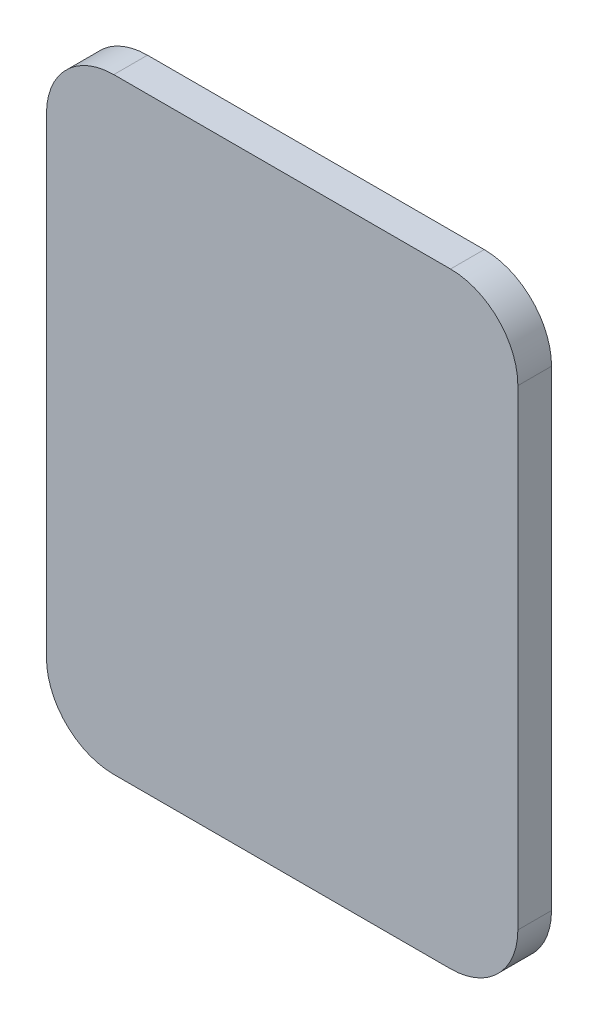
ISO-10303-21;
HEADER;
FILE_DESCRIPTION(('STEP AP214'),'2;1');
FILE_NAME('part.step','',(''),(''),'','','');
FILE_SCHEMA(('AUTOMOTIVE_DESIGN { 1 0 10303 214 1 1 1 1 }'));
ENDSEC;
DATA;
#1=APPLICATION_CONTEXT('core data for automotive mechanical design processes');
#2=APPLICATION_PROTOCOL_DEFINITION('international standard','automotive_design',2000,#1);
#3=PRODUCT_CONTEXT('',#1,'mechanical');
#4=PRODUCT('Part','Part','',(#3));
#5=PRODUCT_RELATED_PRODUCT_CATEGORY('part','',(#4));
#6=PRODUCT_DEFINITION_FORMATION('','',#4);
#7=PRODUCT_DEFINITION_CONTEXT('part definition',#1,'design');
#8=PRODUCT_DEFINITION('design','',#6,#7);
#9=PRODUCT_DEFINITION_SHAPE('','',#8);
#10=(LENGTH_UNIT() NAMED_UNIT(*) SI_UNIT(.MILLI.,.METRE.));
#11=(NAMED_UNIT(*) PLANE_ANGLE_UNIT() SI_UNIT($,.RADIAN.));
#12=(NAMED_UNIT(*) SI_UNIT($,.STERADIAN.) SOLID_ANGLE_UNIT());
#13=UNCERTAINTY_MEASURE_WITH_UNIT(LENGTH_MEASURE(1.E-05),#10,'distance_accuracy_value','');
#14=(GEOMETRIC_REPRESENTATION_CONTEXT(3) GLOBAL_UNCERTAINTY_ASSIGNED_CONTEXT((#13)) GLOBAL_UNIT_ASSIGNED_CONTEXT((#10,
#11,#12)) REPRESENTATION_CONTEXT('',''));
#15=CARTESIAN_POINT('',(0.,0.,0.));
#16=DIRECTION('',(0.,0.,1.));
#17=DIRECTION('',(1.,0.,0.));
#18=AXIS2_PLACEMENT_3D('',#15,#16,#17);
#19=CARTESIAN_POINT('',(0.,0.,0.));
#20=DIRECTION('',(0.,0.,1.));
#21=DIRECTION('',(1.,0.,0.));
#22=AXIS2_PLACEMENT_3D('',#19,#20,#21);
#23=PLANE('',#22);
#24=DIRECTION('',(1.,0.,0.));
#25=VECTOR('',#24,1.);
#26=CARTESIAN_POINT('',(7.50000000000001,28.,0.));
#27=LINE('',#26,#25);
#28=CARTESIAN_POINT('',(15.5,28.,0.));
#29=VERTEX_POINT('',#28);
#30=CARTESIAN_POINT('',(7.50000000000001,28.,0.));
#31=VERTEX_POINT('',#30);
#32=EDGE_CURVE('E234',#29,#31,#27,.F.);
#33=ORIENTED_EDGE('',*,*,#32,.T.);
#34=DIRECTION('',(0.,1.,0.));
#35=VECTOR('',#34,1.);
#36=CARTESIAN_POINT('',(7.50000000000001,25.,0.));
#37=LINE('',#36,#35);
#38=CARTESIAN_POINT('',(7.5,-28.,0.));
#39=VERTEX_POINT('',#38);
#40=EDGE_CURVE('E411',#39,#31,#37,.T.);
#41=ORIENTED_EDGE('',*,*,#40,.F.);
#42=DIRECTION('',(-1.,0.,0.));
#43=VECTOR('',#42,1.);
#44=CARTESIAN_POINT('',(12.5,-28.,0.));
#45=LINE('',#44,#43);
#46=CARTESIAN_POINT('',(15.5,-28.,0.));
#47=VERTEX_POINT('',#46);
#48=EDGE_CURVE('E245',#39,#47,#45,.F.);
#49=ORIENTED_EDGE('',*,*,#48,.T.);
#50=DIRECTION('',(0.,-1.,0.));
#51=VECTOR('',#50,1.);
#52=CARTESIAN_POINT('',(15.5,25.,0.));
#53=LINE('',#52,#51);
#54=EDGE_CURVE('E231',#47,#29,#53,.F.);
#55=ORIENTED_EDGE('',*,*,#54,.T.);
#56=EDGE_LOOP('',(#33,#41,#49,#55));
#57=FACE_BOUND('',#56,.T.);
#58=DIRECTION('',(1.,0.,0.));
#59=VECTOR('',#58,1.);
#60=CARTESIAN_POINT('',(-35.,-45.,0.));
#61=LINE('',#60,#59);
#62=CARTESIAN_POINT('',(-25.,-45.,0.));
#63=VERTEX_POINT('',#62);
#64=CARTESIAN_POINT('',(25.,-45.,0.));
#65=VERTEX_POINT('',#64);
#66=EDGE_CURVE('E377',#63,#65,#61,.T.);
#67=ORIENTED_EDGE('',*,*,#66,.F.);
#68=CARTESIAN_POINT('',(-25.,-35.,0.));
#69=DIRECTION('',(0.,0.,1.));
#70=DIRECTION('',(1.,0.,0.));
#71=AXIS2_PLACEMENT_3D('',#68,#69,#70);
#72=CIRCLE('',#71,10.);
#73=CARTESIAN_POINT('',(-35.,-35.,0.));
#74=VERTEX_POINT('',#73);
#75=EDGE_CURVE('E332',#63,#74,#72,.F.);
#76=ORIENTED_EDGE('',*,*,#75,.T.);
#77=DIRECTION('',(0.,-1.,0.));
#78=VECTOR('',#77,1.);
#79=CARTESIAN_POINT('',(-35.,45.,0.));
#80=LINE('',#79,#78);
#81=CARTESIAN_POINT('',(-35.,35.,0.));
#82=VERTEX_POINT('',#81);
#83=EDGE_CURVE('E369',#82,#74,#80,.T.);
#84=ORIENTED_EDGE('',*,*,#83,.F.);
#85=CARTESIAN_POINT('',(-25.,35.,0.));
#86=DIRECTION('',(0.,0.,1.));
#87=DIRECTION('',(1.,0.,0.));
#88=AXIS2_PLACEMENT_3D('',#85,#86,#87);
#89=CIRCLE('',#88,10.);
#90=CARTESIAN_POINT('',(-25.,45.,0.));
#91=VERTEX_POINT('',#90);
#92=EDGE_CURVE('E326',#82,#91,#89,.F.);
#93=ORIENTED_EDGE('',*,*,#92,.T.);
#94=DIRECTION('',(-1.,0.,0.));
#95=VECTOR('',#94,1.);
#96=CARTESIAN_POINT('',(-35.,45.,0.));
#97=LINE('',#96,#95);
#98=CARTESIAN_POINT('',(25.,45.,0.));
#99=VERTEX_POINT('',#98);
#100=EDGE_CURVE('E366',#99,#91,#97,.T.);
#101=ORIENTED_EDGE('',*,*,#100,.F.);
#102=CARTESIAN_POINT('',(25.,35.,0.));
#103=DIRECTION('',(0.,0.,1.));
#104=DIRECTION('',(1.,0.,0.));
#105=AXIS2_PLACEMENT_3D('',#102,#103,#104);
#106=CIRCLE('',#105,10.);
#107=CARTESIAN_POINT('',(35.,35.,0.));
#108=VERTEX_POINT('',#107);
#109=EDGE_CURVE('E328',#99,#108,#106,.F.);
#110=ORIENTED_EDGE('',*,*,#109,.T.);
#111=DIRECTION('',(0.,1.,0.));
#112=VECTOR('',#111,1.);
#113=CARTESIAN_POINT('',(35.,45.,0.));
#114=LINE('',#113,#112);
#115=CARTESIAN_POINT('',(35.,-35.,0.));
#116=VERTEX_POINT('',#115);
#117=EDGE_CURVE('E356',#116,#108,#114,.T.);
#118=ORIENTED_EDGE('',*,*,#117,.F.);
#119=CARTESIAN_POINT('',(25.,-35.,0.));
#120=DIRECTION('',(0.,0.,1.));
#121=DIRECTION('',(1.,0.,0.));
#122=AXIS2_PLACEMENT_3D('',#119,#120,#121);
#123=CIRCLE('',#122,10.);
#124=EDGE_CURVE('E330',#116,#65,#123,.F.);
#125=ORIENTED_EDGE('',*,*,#124,.T.);
#126=EDGE_LOOP('',(#67,#76,#84,#93,#101,#110,#118,#125));
#127=FACE_BOUND('',#126,.T.);
#128=DIRECTION('',(0.,-1.,0.));
#129=VECTOR('',#128,1.);
#130=CARTESIAN_POINT('',(-7.50000000000001,25.,0.));
#131=LINE('',#130,#129);
#132=CARTESIAN_POINT('',(-7.50000000000001,28.,0.));
#133=VERTEX_POINT('',#132);
#134=CARTESIAN_POINT('',(-7.50000000000001,-28.,0.));
#135=VERTEX_POINT('',#134);
#136=EDGE_CURVE('E399',#133,#135,#131,.T.);
#137=ORIENTED_EDGE('',*,*,#136,.F.);
#138=DIRECTION('',(1.,0.,0.));
#139=VECTOR('',#138,1.);
#140=CARTESIAN_POINT('',(-12.5,28.,0.));
#141=LINE('',#140,#139);
#142=CARTESIAN_POINT('',(-15.5,28.,0.));
#143=VERTEX_POINT('',#142);
#144=EDGE_CURVE('E224',#133,#143,#141,.F.);
#145=ORIENTED_EDGE('',*,*,#144,.T.);
#146=DIRECTION('',(0.,1.,0.));
#147=VECTOR('',#146,1.);
#148=CARTESIAN_POINT('',(-15.5,-25.,0.));
#149=LINE('',#148,#147);
#150=CARTESIAN_POINT('',(-15.5,-28.,0.));
#151=VERTEX_POINT('',#150);
#152=EDGE_CURVE('E250',#143,#151,#149,.F.);
#153=ORIENTED_EDGE('',*,*,#152,.T.);
#154=DIRECTION('',(-1.,0.,0.));
#155=VECTOR('',#154,1.);
#156=CARTESIAN_POINT('',(-7.50000000000001,-28.,0.));
#157=LINE('',#156,#155);
#158=EDGE_CURVE('E247',#151,#135,#157,.F.);
#159=ORIENTED_EDGE('',*,*,#158,.T.);
#160=EDGE_LOOP('',(#137,#145,#153,#159));
#161=FACE_BOUND('',#160,.T.);
#162=ADVANCED_FACE('F44',(#57,#127,#161),#23,.F.);
#163=CARTESIAN_POINT('',(35.,45.,5.));
#164=DIRECTION('',(-1.,0.,0.));
#165=DIRECTION('',(0.,-1.,0.));
#166=AXIS2_PLACEMENT_3D('',#163,#164,#165);
#167=PLANE('',#166);
#168=DIRECTION('',(0.,1.,0.));
#169=VECTOR('',#168,1.);
#170=CARTESIAN_POINT('',(35.,45.,5.));
#171=LINE('',#170,#169);
#172=CARTESIAN_POINT('',(35.,-35.,5.));
#173=VERTEX_POINT('',#172);
#174=CARTESIAN_POINT('',(35.,35.,5.));
#175=VERTEX_POINT('',#174);
#176=EDGE_CURVE('E358',#173,#175,#171,.T.);
#177=ORIENTED_EDGE('',*,*,#176,.F.);
#178=DIRECTION('',(0.,0.,-1.));
#179=VECTOR('',#178,1.);
#180=CARTESIAN_POINT('',(35.,-35.,5.));
#181=LINE('',#180,#179);
#182=EDGE_CURVE('E348',#173,#116,#181,.T.);
#183=ORIENTED_EDGE('',*,*,#182,.T.);
#184=ORIENTED_EDGE('',*,*,#117,.T.);
#185=DIRECTION('',(0.,0.,-1.));
#186=VECTOR('',#185,1.);
#187=CARTESIAN_POINT('',(35.,35.,5.));
#188=LINE('',#187,#186);
#189=EDGE_CURVE('E346',#108,#175,#188,.F.);
#190=ORIENTED_EDGE('',*,*,#189,.T.);
#191=EDGE_LOOP('',(#177,#183,#184,#190));
#192=FACE_BOUND('',#191,.T.);
#193=ADVANCED_FACE('F355',(#192),#167,.F.);
#194=CARTESIAN_POINT('',(-35.,45.,5.));
#195=DIRECTION('',(0.,-1.,0.));
#196=DIRECTION('',(0.,0.,-1.));
#197=AXIS2_PLACEMENT_3D('',#194,#195,#196);
#198=PLANE('',#197);
#199=DIRECTION('',(-1.,0.,0.));
#200=VECTOR('',#199,1.);
#201=CARTESIAN_POINT('',(-35.,45.,5.));
#202=LINE('',#201,#200);
#203=CARTESIAN_POINT('',(25.,45.,5.));
#204=VERTEX_POINT('',#203);
#205=CARTESIAN_POINT('',(-25.,45.,5.));
#206=VERTEX_POINT('',#205);
#207=EDGE_CURVE('E425',#204,#206,#202,.T.);
#208=ORIENTED_EDGE('',*,*,#207,.F.);
#209=DIRECTION('',(0.,0.,-1.));
#210=VECTOR('',#209,1.);
#211=CARTESIAN_POINT('',(25.,45.,5.));
#212=LINE('',#211,#210);
#213=EDGE_CURVE('E13',#204,#99,#212,.T.);
#214=ORIENTED_EDGE('',*,*,#213,.T.);
#215=ORIENTED_EDGE('',*,*,#100,.T.);
#216=DIRECTION('',(0.,0.,-1.));
#217=VECTOR('',#216,1.);
#218=CARTESIAN_POINT('',(-25.,45.,5.));
#219=LINE('',#218,#217);
#220=EDGE_CURVE('E52',#91,#206,#219,.F.);
#221=ORIENTED_EDGE('',*,*,#220,.T.);
#222=EDGE_LOOP('',(#208,#214,#215,#221));
#223=FACE_BOUND('',#222,.T.);
#224=ADVANCED_FACE('F444',(#223),#198,.F.);
#225=CARTESIAN_POINT('',(-35.,45.,5.));
#226=DIRECTION('',(1.,0.,0.));
#227=DIRECTION('',(0.,1.,0.));
#228=AXIS2_PLACEMENT_3D('',#225,#226,#227);
#229=PLANE('',#228);
#230=ORIENTED_EDGE('',*,*,#83,.T.);
#231=DIRECTION('',(0.,0.,-1.));
#232=VECTOR('',#231,1.);
#233=CARTESIAN_POINT('',(-35.,-35.,5.));
#234=LINE('',#233,#232);
#235=CARTESIAN_POINT('',(-35.,-35.,5.));
#236=VERTEX_POINT('',#235);
#237=EDGE_CURVE('E337',#74,#236,#234,.F.);
#238=ORIENTED_EDGE('',*,*,#237,.T.);
#239=DIRECTION('',(0.,-1.,0.));
#240=VECTOR('',#239,1.);
#241=CARTESIAN_POINT('',(-35.,45.,5.));
#242=LINE('',#241,#240);
#243=CARTESIAN_POINT('',(-35.,35.,5.));
#244=VERTEX_POINT('',#243);
#245=EDGE_CURVE('E237',#244,#236,#242,.T.);
#246=ORIENTED_EDGE('',*,*,#245,.F.);
#247=DIRECTION('',(0.,0.,-1.));
#248=VECTOR('',#247,1.);
#249=CARTESIAN_POINT('',(-35.,35.,5.));
#250=LINE('',#249,#248);
#251=EDGE_CURVE('E334',#244,#82,#250,.T.);
#252=ORIENTED_EDGE('',*,*,#251,.T.);
#253=EDGE_LOOP('',(#230,#238,#246,#252));
#254=FACE_BOUND('',#253,.T.);
#255=ADVANCED_FACE('F442',(#254),#229,.F.);
#256=CARTESIAN_POINT('',(-35.,-45.,5.));
#257=DIRECTION('',(0.,1.,0.));
#258=DIRECTION('',(0.,0.,1.));
#259=AXIS2_PLACEMENT_3D('',#256,#257,#258);
#260=PLANE('',#259);
#261=DIRECTION('',(1.,0.,0.));
#262=VECTOR('',#261,1.);
#263=CARTESIAN_POINT('',(-35.,-45.,5.));
#264=LINE('',#263,#262);
#265=CARTESIAN_POINT('',(-25.,-45.,5.));
#266=VERTEX_POINT('',#265);
#267=CARTESIAN_POINT('',(25.,-45.,5.));
#268=VERTEX_POINT('',#267);
#269=EDGE_CURVE('E232',#266,#268,#264,.T.);
#270=ORIENTED_EDGE('',*,*,#269,.F.);
#271=DIRECTION('',(0.,0.,-1.));
#272=VECTOR('',#271,1.);
#273=CARTESIAN_POINT('',(-25.,-45.,5.));
#274=LINE('',#273,#272);
#275=EDGE_CURVE('E323',#266,#63,#274,.T.);
#276=ORIENTED_EDGE('',*,*,#275,.T.);
#277=ORIENTED_EDGE('',*,*,#66,.T.);
#278=DIRECTION('',(0.,0.,-1.));
#279=VECTOR('',#278,1.);
#280=CARTESIAN_POINT('',(25.,-45.,5.));
#281=LINE('',#280,#279);
#282=EDGE_CURVE('E321',#65,#268,#281,.F.);
#283=ORIENTED_EDGE('',*,*,#282,.T.);
#284=EDGE_LOOP('',(#270,#276,#277,#283));
#285=FACE_BOUND('',#284,.T.);
#286=ADVANCED_FACE('F439',(#285),#260,.F.);
#287=CARTESIAN_POINT('',(0.,0.,5.));
#288=DIRECTION('',(0.,0.,1.));
#289=DIRECTION('',(1.,0.,0.));
#290=AXIS2_PLACEMENT_3D('',#287,#288,#289);
#291=PLANE('',#290);
#292=ORIENTED_EDGE('',*,*,#245,.T.);
#293=CARTESIAN_POINT('',(-25.,-35.,5.));
#294=DIRECTION('',(0.,0.,1.));
#295=DIRECTION('',(1.,0.,0.));
#296=AXIS2_PLACEMENT_3D('',#293,#294,#295);
#297=CIRCLE('',#296,10.);
#298=EDGE_CURVE('E344',#236,#266,#297,.T.);
#299=ORIENTED_EDGE('',*,*,#298,.T.);
#300=ORIENTED_EDGE('',*,*,#269,.T.);
#301=CARTESIAN_POINT('',(25.,-35.,5.));
#302=DIRECTION('',(0.,0.,1.));
#303=DIRECTION('',(1.,0.,0.));
#304=AXIS2_PLACEMENT_3D('',#301,#302,#303);
#305=CIRCLE('',#304,10.);
#306=EDGE_CURVE('E342',#268,#173,#305,.T.);
#307=ORIENTED_EDGE('',*,*,#306,.T.);
#308=ORIENTED_EDGE('',*,*,#176,.T.);
#309=CARTESIAN_POINT('',(25.,35.,5.));
#310=DIRECTION('',(0.,0.,1.));
#311=DIRECTION('',(1.,0.,0.));
#312=AXIS2_PLACEMENT_3D('',#309,#310,#311);
#313=CIRCLE('',#312,10.);
#314=EDGE_CURVE('E65',#175,#204,#313,.T.);
#315=ORIENTED_EDGE('',*,*,#314,.T.);
#316=ORIENTED_EDGE('',*,*,#207,.T.);
#317=CARTESIAN_POINT('',(-25.,35.,5.));
#318=DIRECTION('',(0.,0.,1.));
#319=DIRECTION('',(1.,0.,0.));
#320=AXIS2_PLACEMENT_3D('',#317,#318,#319);
#321=CIRCLE('',#320,10.);
#322=EDGE_CURVE('E339',#206,#244,#321,.T.);
#323=ORIENTED_EDGE('',*,*,#322,.T.);
#324=EDGE_LOOP('',(#292,#299,#300,#307,#308,#315,#316,#323));
#325=FACE_BOUND('',#324,.T.);
#326=ADVANCED_FACE('F429',(#325),#291,.T.);
#327=CARTESIAN_POINT('',(7.50000000000001,25.,-20.));
#328=DIRECTION('',(1.,0.,0.));
#329=DIRECTION('',(0.,1.,0.));
#330=AXIS2_PLACEMENT_3D('',#327,#328,#329);
#331=PLANE('',#330);
#332=CARTESIAN_POINT('',(7.5,-12.5,-10.));
#333=DIRECTION('',(1.,0.,0.));
#334=DIRECTION('',(0.,1.,0.));
#335=AXIS2_PLACEMENT_3D('',#332,#333,#334);
#336=CIRCLE('',#335,3.);
#337=CARTESIAN_POINT('',(7.5,-9.5,-10.));
#338=VERTEX_POINT('',#337);
#339=EDGE_CURVE('E388',#338,#338,#336,.T.);
#340=ORIENTED_EDGE('',*,*,#339,.T.);
#341=EDGE_LOOP('',(#340));
#342=FACE_BOUND('',#341,.T.);
#343=CARTESIAN_POINT('',(7.50000000000001,12.5,-10.));
#344=DIRECTION('',(1.,0.,0.));
#345=DIRECTION('',(0.,1.,0.));
#346=AXIS2_PLACEMENT_3D('',#343,#344,#345);
#347=CIRCLE('',#346,3.);
#348=CARTESIAN_POINT('',(7.50000000000001,15.5,-10.));
#349=VERTEX_POINT('',#348);
#350=EDGE_CURVE('E385',#349,#349,#347,.T.);
#351=ORIENTED_EDGE('',*,*,#350,.T.);
#352=EDGE_LOOP('',(#351));
#353=FACE_BOUND('',#352,.T.);
#354=DIRECTION('',(0.,1.,0.));
#355=VECTOR('',#354,1.);
#356=CARTESIAN_POINT('',(7.50000000000001,25.,-20.));
#357=LINE('',#356,#355);
#358=CARTESIAN_POINT('',(7.5,-15.,-20.));
#359=VERTEX_POINT('',#358);
#360=CARTESIAN_POINT('',(7.5,15.,-20.));
#361=VERTEX_POINT('',#360);
#362=EDGE_CURVE('E412',#359,#361,#357,.T.);
#363=ORIENTED_EDGE('',*,*,#362,.F.);
#364=CARTESIAN_POINT('',(7.5,-15.,-10.));
#365=DIRECTION('',(1.,0.,0.));
#366=DIRECTION('',(0.,1.,0.));
#367=AXIS2_PLACEMENT_3D('',#364,#365,#366);
#368=CIRCLE('',#367,10.);
#369=CARTESIAN_POINT('',(7.5,-25.,-10.));
#370=VERTEX_POINT('',#369);
#371=EDGE_CURVE('E311',#359,#370,#368,.F.);
#372=ORIENTED_EDGE('',*,*,#371,.T.);
#373=DIRECTION('',(0.,0.,1.));
#374=VECTOR('',#373,1.);
#375=CARTESIAN_POINT('',(7.5,-25.,-20.));
#376=LINE('',#375,#374);
#377=CARTESIAN_POINT('',(7.5,-25.,-3.));
#378=VERTEX_POINT('',#377);
#379=EDGE_CURVE('E418',#370,#378,#376,.T.);
#380=ORIENTED_EDGE('',*,*,#379,.T.);
#381=CARTESIAN_POINT('',(7.5,-28.,-3.));
#382=DIRECTION('',(1.,0.,0.));
#383=DIRECTION('',(0.,1.,0.));
#384=AXIS2_PLACEMENT_3D('',#381,#382,#383);
#385=CIRCLE('',#384,3.);
#386=EDGE_CURVE('E268',#378,#39,#385,.T.);
#387=ORIENTED_EDGE('',*,*,#386,.T.);
#388=ORIENTED_EDGE('',*,*,#40,.T.);
#389=CARTESIAN_POINT('',(7.50000000000001,28.,-3.));
#390=DIRECTION('',(1.,0.,0.));
#391=DIRECTION('',(0.,1.,0.));
#392=AXIS2_PLACEMENT_3D('',#389,#390,#391);
#393=CIRCLE('',#392,3.);
#394=CARTESIAN_POINT('',(7.50000000000001,25.,-3.));
#395=VERTEX_POINT('',#394);
#396=EDGE_CURVE('E271',#31,#395,#393,.T.);
#397=ORIENTED_EDGE('',*,*,#396,.T.);
#398=DIRECTION('',(0.,0.,1.));
#399=VECTOR('',#398,1.);
#400=CARTESIAN_POINT('',(7.50000000000001,25.,-20.));
#401=LINE('',#400,#399);
#402=CARTESIAN_POINT('',(7.50000000000001,25.,-10.));
#403=VERTEX_POINT('',#402);
#404=EDGE_CURVE('E367',#403,#395,#401,.T.);
#405=ORIENTED_EDGE('',*,*,#404,.F.);
#406=CARTESIAN_POINT('',(7.5,15.,-10.));
#407=DIRECTION('',(1.,0.,0.));
#408=DIRECTION('',(0.,1.,0.));
#409=AXIS2_PLACEMENT_3D('',#406,#407,#408);
#410=CIRCLE('',#409,10.);
#411=EDGE_CURVE('E309',#403,#361,#410,.F.);
#412=ORIENTED_EDGE('',*,*,#411,.T.);
#413=EDGE_LOOP('',(#363,#372,#380,#387,#388,#397,#405,#412));
#414=FACE_BOUND('',#413,.T.);
#415=ADVANCED_FACE('F518',(#342,#353,#414),#331,.F.);
#416=CARTESIAN_POINT('',(12.5,25.,-20.));
#417=DIRECTION('',(0.,-1.,0.));
#418=DIRECTION('',(0.,0.,-1.));
#419=AXIS2_PLACEMENT_3D('',#416,#417,#418);
#420=PLANE('',#419);
#421=DIRECTION('',(0.,0.,1.));
#422=VECTOR('',#421,1.);
#423=CARTESIAN_POINT('',(12.5,25.,-20.));
#424=LINE('',#423,#422);
#425=CARTESIAN_POINT('',(12.5,25.,-10.));
#426=VERTEX_POINT('',#425);
#427=CARTESIAN_POINT('',(12.5,25.,-3.));
#428=VERTEX_POINT('',#427);
#429=EDGE_CURVE('E371',#426,#428,#424,.T.);
#430=ORIENTED_EDGE('',*,*,#429,.F.);
#431=DIRECTION('',(1.,0.,0.));
#432=VECTOR('',#431,1.);
#433=CARTESIAN_POINT('',(7.50000000000001,25.,-10.));
#434=LINE('',#433,#432);
#435=EDGE_CURVE('E319',#426,#403,#434,.F.);
#436=ORIENTED_EDGE('',*,*,#435,.T.);
#437=ORIENTED_EDGE('',*,*,#404,.T.);
#438=DIRECTION('',(1.,0.,0.));
#439=VECTOR('',#438,1.);
#440=CARTESIAN_POINT('',(12.5,25.,-3.));
#441=LINE('',#440,#439);
#442=EDGE_CURVE('E261',#395,#428,#441,.T.);
#443=ORIENTED_EDGE('',*,*,#442,.T.);
#444=EDGE_LOOP('',(#430,#436,#437,#443));
#445=FACE_BOUND('',#444,.T.);
#446=ADVANCED_FACE('F541',(#445),#420,.F.);
#447=CARTESIAN_POINT('',(12.5,25.,-20.));
#448=DIRECTION('',(-1.,0.,0.));
#449=DIRECTION('',(0.,-1.,0.));
#450=AXIS2_PLACEMENT_3D('',#447,#448,#449);
#451=PLANE('',#450);
#452=CARTESIAN_POINT('',(12.5,-12.5,-10.));
#453=DIRECTION('',(1.,0.,0.));
#454=DIRECTION('',(0.,1.,0.));
#455=AXIS2_PLACEMENT_3D('',#452,#453,#454);
#456=CIRCLE('',#455,3.);
#457=CARTESIAN_POINT('',(12.5,-9.5,-10.));
#458=VERTEX_POINT('',#457);
#459=EDGE_CURVE('E281',#458,#458,#456,.T.);
#460=ORIENTED_EDGE('',*,*,#459,.F.);
#461=EDGE_LOOP('',(#460));
#462=FACE_BOUND('',#461,.T.);
#463=CARTESIAN_POINT('',(12.5,12.5,-10.));
#464=DIRECTION('',(1.,0.,0.));
#465=DIRECTION('',(0.,1.,0.));
#466=AXIS2_PLACEMENT_3D('',#463,#464,#465);
#467=CIRCLE('',#466,3.);
#468=CARTESIAN_POINT('',(12.5,15.5,-10.));
#469=VERTEX_POINT('',#468);
#470=EDGE_CURVE('E381',#469,#469,#467,.T.);
#471=ORIENTED_EDGE('',*,*,#470,.F.);
#472=EDGE_LOOP('',(#471));
#473=FACE_BOUND('',#472,.T.);
#474=DIRECTION('',(0.,0.,1.));
#475=VECTOR('',#474,1.);
#476=CARTESIAN_POINT('',(12.5,-25.,-20.));
#477=LINE('',#476,#475);
#478=CARTESIAN_POINT('',(12.5,-25.,-10.));
#479=VERTEX_POINT('',#478);
#480=CARTESIAN_POINT('',(12.5,-25.,-3.));
#481=VERTEX_POINT('',#480);
#482=EDGE_CURVE('E421',#479,#481,#477,.T.);
#483=ORIENTED_EDGE('',*,*,#482,.F.);
#484=CARTESIAN_POINT('',(12.5,-15.,-10.));
#485=DIRECTION('',(-1.,0.,0.));
#486=DIRECTION('',(0.,-1.,0.));
#487=AXIS2_PLACEMENT_3D('',#484,#485,#486);
#488=CIRCLE('',#487,10.);
#489=CARTESIAN_POINT('',(12.5,-15.,-20.));
#490=VERTEX_POINT('',#489);
#491=EDGE_CURVE('E317',#479,#490,#488,.F.);
#492=ORIENTED_EDGE('',*,*,#491,.T.);
#493=DIRECTION('',(0.,-1.,0.));
#494=VECTOR('',#493,1.);
#495=CARTESIAN_POINT('',(12.5,25.,-20.));
#496=LINE('',#495,#494);
#497=CARTESIAN_POINT('',(12.5,15.,-20.));
#498=VERTEX_POINT('',#497);
#499=EDGE_CURVE('E415',#498,#490,#496,.T.);
#500=ORIENTED_EDGE('',*,*,#499,.F.);
#501=CARTESIAN_POINT('',(12.5,15.,-10.));
#502=DIRECTION('',(-1.,0.,0.));
#503=DIRECTION('',(0.,-1.,0.));
#504=AXIS2_PLACEMENT_3D('',#501,#502,#503);
#505=CIRCLE('',#504,10.);
#506=EDGE_CURVE('E315',#498,#426,#505,.F.);
#507=ORIENTED_EDGE('',*,*,#506,.T.);
#508=ORIENTED_EDGE('',*,*,#429,.T.);
#509=DIRECTION('',(0.,-1.,0.));
#510=VECTOR('',#509,1.);
#511=CARTESIAN_POINT('',(12.5,-25.,-3.));
#512=LINE('',#511,#510);
#513=EDGE_CURVE('E226',#428,#481,#512,.T.);
#514=ORIENTED_EDGE('',*,*,#513,.T.);
#515=EDGE_LOOP('',(#483,#492,#500,#507,#508,#514));
#516=FACE_BOUND('',#515,.T.);
#517=ADVANCED_FACE('F543',(#462,#473,#516),#451,.F.);
#518=CARTESIAN_POINT('',(12.5,-25.,-20.));
#519=DIRECTION('',(0.,1.,0.));
#520=DIRECTION('',(0.,0.,1.));
#521=AXIS2_PLACEMENT_3D('',#518,#519,#520);
#522=PLANE('',#521);
#523=ORIENTED_EDGE('',*,*,#379,.F.);
#524=DIRECTION('',(-1.,0.,0.));
#525=VECTOR('',#524,1.);
#526=CARTESIAN_POINT('',(12.5,-25.,-10.));
#527=LINE('',#526,#525);
#528=EDGE_CURVE('E313',#370,#479,#527,.F.);
#529=ORIENTED_EDGE('',*,*,#528,.T.);
#530=ORIENTED_EDGE('',*,*,#482,.T.);
#531=DIRECTION('',(-1.,0.,0.));
#532=VECTOR('',#531,1.);
#533=CARTESIAN_POINT('',(7.5,-25.,-3.));
#534=LINE('',#533,#532);
#535=EDGE_CURVE('E258',#481,#378,#534,.T.);
#536=ORIENTED_EDGE('',*,*,#535,.T.);
#537=EDGE_LOOP('',(#523,#529,#530,#536));
#538=FACE_BOUND('',#537,.T.);
#539=ADVANCED_FACE('F528',(#538),#522,.F.);
#540=CARTESIAN_POINT('',(0.,0.,-20.));
#541=DIRECTION('',(0.,0.,-1.));
#542=DIRECTION('',(-1.,0.,0.));
#543=AXIS2_PLACEMENT_3D('',#540,#541,#542);
#544=PLANE('',#543);
#545=ORIENTED_EDGE('',*,*,#499,.T.);
#546=DIRECTION('',(-1.,0.,0.));
#547=VECTOR('',#546,1.);
#548=CARTESIAN_POINT('',(7.5,-15.,-20.));
#549=LINE('',#548,#547);
#550=EDGE_CURVE('E306',#490,#359,#549,.T.);
#551=ORIENTED_EDGE('',*,*,#550,.T.);
#552=ORIENTED_EDGE('',*,*,#362,.T.);
#553=DIRECTION('',(1.,0.,0.));
#554=VECTOR('',#553,1.);
#555=CARTESIAN_POINT('',(12.5,15.,-20.));
#556=LINE('',#555,#554);
#557=EDGE_CURVE('E303',#361,#498,#556,.T.);
#558=ORIENTED_EDGE('',*,*,#557,.T.);
#559=EDGE_LOOP('',(#545,#551,#552,#558));
#560=FACE_BOUND('',#559,.T.);
#561=ADVANCED_FACE('F520',(#560),#544,.T.);
#562=CARTESIAN_POINT('',(-12.5,25.,-20.));
#563=DIRECTION('',(1.,0.,0.));
#564=DIRECTION('',(0.,1.,0.));
#565=AXIS2_PLACEMENT_3D('',#562,#563,#564);
#566=PLANE('',#565);
#567=CARTESIAN_POINT('',(-12.5,-12.5,-10.));
#568=DIRECTION('',(1.,0.,0.));
#569=DIRECTION('',(0.,1.,0.));
#570=AXIS2_PLACEMENT_3D('',#567,#568,#569);
#571=CIRCLE('',#570,3.);
#572=CARTESIAN_POINT('',(-12.5,-9.5,-10.));
#573=VERTEX_POINT('',#572);
#574=EDGE_CURVE('E393',#573,#573,#571,.T.);
#575=ORIENTED_EDGE('',*,*,#574,.T.);
#576=EDGE_LOOP('',(#575));
#577=FACE_BOUND('',#576,.T.);
#578=CARTESIAN_POINT('',(-12.5,12.5,-10.));
#579=DIRECTION('',(1.,0.,0.));
#580=DIRECTION('',(0.,1.,0.));
#581=AXIS2_PLACEMENT_3D('',#578,#579,#580);
#582=CIRCLE('',#581,3.);
#583=CARTESIAN_POINT('',(-12.5,15.5,-10.));
#584=VERTEX_POINT('',#583);
#585=EDGE_CURVE('E380',#584,#584,#582,.T.);
#586=ORIENTED_EDGE('',*,*,#585,.T.);
#587=EDGE_LOOP('',(#586));
#588=FACE_BOUND('',#587,.T.);
#589=DIRECTION('',(0.,0.,1.));
#590=VECTOR('',#589,1.);
#591=CARTESIAN_POINT('',(-12.5,25.,-20.));
#592=LINE('',#591,#590);
#593=CARTESIAN_POINT('',(-12.5,25.,-10.));
#594=VERTEX_POINT('',#593);
#595=CARTESIAN_POINT('',(-12.5,25.,-3.));
#596=VERTEX_POINT('',#595);
#597=EDGE_CURVE('E216',#594,#596,#592,.T.);
#598=ORIENTED_EDGE('',*,*,#597,.F.);
#599=CARTESIAN_POINT('',(-12.5,15.,-10.));
#600=DIRECTION('',(1.,0.,0.));
#601=DIRECTION('',(0.,1.,0.));
#602=AXIS2_PLACEMENT_3D('',#599,#600,#601);
#603=CIRCLE('',#602,10.);
#604=CARTESIAN_POINT('',(-12.5,15.,-20.));
#605=VERTEX_POINT('',#604);
#606=EDGE_CURVE('E299',#594,#605,#603,.F.);
#607=ORIENTED_EDGE('',*,*,#606,.T.);
#608=DIRECTION('',(0.,1.,0.));
#609=VECTOR('',#608,1.);
#610=CARTESIAN_POINT('',(-12.5,25.,-20.));
#611=LINE('',#610,#609);
#612=CARTESIAN_POINT('',(-12.5,-15.,-20.));
#613=VERTEX_POINT('',#612);
#614=EDGE_CURVE('E400',#613,#605,#611,.T.);
#615=ORIENTED_EDGE('',*,*,#614,.F.);
#616=CARTESIAN_POINT('',(-12.5,-15.,-10.));
#617=DIRECTION('',(1.,0.,0.));
#618=DIRECTION('',(0.,1.,0.));
#619=AXIS2_PLACEMENT_3D('',#616,#617,#618);
#620=CIRCLE('',#619,10.);
#621=CARTESIAN_POINT('',(-12.5,-25.,-10.));
#622=VERTEX_POINT('',#621);
#623=EDGE_CURVE('E297',#613,#622,#620,.F.);
#624=ORIENTED_EDGE('',*,*,#623,.T.);
#625=DIRECTION('',(0.,0.,1.));
#626=VECTOR('',#625,1.);
#627=CARTESIAN_POINT('',(-12.5,-25.,-20.));
#628=LINE('',#627,#626);
#629=CARTESIAN_POINT('',(-12.5,-25.,-3.));
#630=VERTEX_POINT('',#629);
#631=EDGE_CURVE('E406',#622,#630,#628,.T.);
#632=ORIENTED_EDGE('',*,*,#631,.T.);
#633=DIRECTION('',(0.,1.,0.));
#634=VECTOR('',#633,1.);
#635=CARTESIAN_POINT('',(-12.5,25.,-3.));
#636=LINE('',#635,#634);
#637=EDGE_CURVE('E253',#630,#596,#636,.T.);
#638=ORIENTED_EDGE('',*,*,#637,.T.);
#639=EDGE_LOOP('',(#598,#607,#615,#624,#632,#638));
#640=FACE_BOUND('',#639,.T.);
#641=ADVANCED_FACE('F591',(#577,#588,#640),#566,.F.);
#642=CARTESIAN_POINT('',(-12.5,25.,-20.));
#643=DIRECTION('',(0.,-1.,0.));
#644=DIRECTION('',(0.,0.,-1.));
#645=AXIS2_PLACEMENT_3D('',#642,#643,#644);
#646=PLANE('',#645);
#647=DIRECTION('',(0.,0.,1.));
#648=VECTOR('',#647,1.);
#649=CARTESIAN_POINT('',(-7.50000000000001,25.,-20.));
#650=LINE('',#649,#648);
#651=CARTESIAN_POINT('',(-7.50000000000001,25.,-10.));
#652=VERTEX_POINT('',#651);
#653=CARTESIAN_POINT('',(-7.50000000000001,25.,-3.));
#654=VERTEX_POINT('',#653);
#655=EDGE_CURVE('E206',#652,#654,#650,.T.);
#656=ORIENTED_EDGE('',*,*,#655,.F.);
#657=DIRECTION('',(1.,0.,0.));
#658=VECTOR('',#657,1.);
#659=CARTESIAN_POINT('',(-12.5,25.,-10.));
#660=LINE('',#659,#658);
#661=EDGE_CURVE('E295',#652,#594,#660,.F.);
#662=ORIENTED_EDGE('',*,*,#661,.T.);
#663=ORIENTED_EDGE('',*,*,#597,.T.);
#664=DIRECTION('',(1.,0.,0.));
#665=VECTOR('',#664,1.);
#666=CARTESIAN_POINT('',(-7.50000000000001,25.,-3.));
#667=LINE('',#666,#665);
#668=EDGE_CURVE('E223',#596,#654,#667,.T.);
#669=ORIENTED_EDGE('',*,*,#668,.T.);
#670=EDGE_LOOP('',(#656,#662,#663,#669));
#671=FACE_BOUND('',#670,.T.);
#672=ADVANCED_FACE('F228',(#671),#646,.F.);
#673=CARTESIAN_POINT('',(-7.50000000000001,25.,-20.));
#674=DIRECTION('',(-1.,0.,0.));
#675=DIRECTION('',(0.,-1.,0.));
#676=AXIS2_PLACEMENT_3D('',#673,#674,#675);
#677=PLANE('',#676);
#678=CARTESIAN_POINT('',(-7.50000000000001,-12.5,-10.));
#679=DIRECTION('',(-1.,0.,0.));
#680=DIRECTION('',(0.,-1.,0.));
#681=AXIS2_PLACEMENT_3D('',#678,#679,#680);
#682=CIRCLE('',#681,3.);
#683=CARTESIAN_POINT('',(-7.50000000000001,-15.5,-10.));
#684=VERTEX_POINT('',#683);
#685=EDGE_CURVE('E240',#684,#684,#682,.T.);
#686=ORIENTED_EDGE('',*,*,#685,.T.);
#687=EDGE_LOOP('',(#686));
#688=FACE_BOUND('',#687,.T.);
#689=CARTESIAN_POINT('',(-7.50000000000001,12.5,-10.));
#690=DIRECTION('',(-1.,0.,0.));
#691=DIRECTION('',(0.,-1.,0.));
#692=AXIS2_PLACEMENT_3D('',#689,#690,#691);
#693=CIRCLE('',#692,3.);
#694=CARTESIAN_POINT('',(-7.50000000000001,9.50000000000001,-10.));
#695=VERTEX_POINT('',#694);
#696=EDGE_CURVE('E378',#695,#695,#693,.T.);
#697=ORIENTED_EDGE('',*,*,#696,.T.);
#698=EDGE_LOOP('',(#697));
#699=FACE_BOUND('',#698,.T.);
#700=DIRECTION('',(0.,-1.,0.));
#701=VECTOR('',#700,1.);
#702=CARTESIAN_POINT('',(-7.50000000000001,25.,-20.));
#703=LINE('',#702,#701);
#704=CARTESIAN_POINT('',(-7.50000000000001,15.,-20.));
#705=VERTEX_POINT('',#704);
#706=CARTESIAN_POINT('',(-7.50000000000001,-15.,-20.));
#707=VERTEX_POINT('',#706);
#708=EDGE_CURVE('E403',#705,#707,#703,.T.);
#709=ORIENTED_EDGE('',*,*,#708,.F.);
#710=CARTESIAN_POINT('',(-7.50000000000001,15.,-10.));
#711=DIRECTION('',(-1.,0.,0.));
#712=DIRECTION('',(0.,-1.,0.));
#713=AXIS2_PLACEMENT_3D('',#710,#711,#712);
#714=CIRCLE('',#713,10.);
#715=EDGE_CURVE('E212',#705,#652,#714,.F.);
#716=ORIENTED_EDGE('',*,*,#715,.T.);
#717=ORIENTED_EDGE('',*,*,#655,.T.);
#718=CARTESIAN_POINT('',(-7.50000000000001,28.,-3.));
#719=DIRECTION('',(-1.,0.,0.));
#720=DIRECTION('',(0.,-1.,0.));
#721=AXIS2_PLACEMENT_3D('',#718,#719,#720);
#722=CIRCLE('',#721,3.);
#723=EDGE_CURVE('E210',#654,#133,#722,.T.);
#724=ORIENTED_EDGE('',*,*,#723,.T.);
#725=ORIENTED_EDGE('',*,*,#136,.T.);
#726=CARTESIAN_POINT('',(-7.50000000000001,-28.,-3.));
#727=DIRECTION('',(-1.,0.,0.));
#728=DIRECTION('',(0.,-1.,0.));
#729=AXIS2_PLACEMENT_3D('',#726,#727,#728);
#730=CIRCLE('',#729,3.);
#731=CARTESIAN_POINT('',(-7.50000000000001,-25.,-3.));
#732=VERTEX_POINT('',#731);
#733=EDGE_CURVE('E225',#135,#732,#730,.T.);
#734=ORIENTED_EDGE('',*,*,#733,.T.);
#735=DIRECTION('',(0.,0.,1.));
#736=VECTOR('',#735,1.);
#737=CARTESIAN_POINT('',(-7.50000000000001,-25.,-20.));
#738=LINE('',#737,#736);
#739=CARTESIAN_POINT('',(-7.50000000000001,-25.,-10.));
#740=VERTEX_POINT('',#739);
#741=EDGE_CURVE('E217',#740,#732,#738,.T.);
#742=ORIENTED_EDGE('',*,*,#741,.F.);
#743=CARTESIAN_POINT('',(-7.50000000000001,-15.,-10.));
#744=DIRECTION('',(-1.,0.,0.));
#745=DIRECTION('',(0.,-1.,0.));
#746=AXIS2_PLACEMENT_3D('',#743,#744,#745);
#747=CIRCLE('',#746,10.);
#748=EDGE_CURVE('E292',#740,#707,#747,.F.);
#749=ORIENTED_EDGE('',*,*,#748,.T.);
#750=EDGE_LOOP('',(#709,#716,#717,#724,#725,#734,#742,#749));
#751=FACE_BOUND('',#750,.T.);
#752=ADVANCED_FACE('F209',(#688,#699,#751),#677,.F.);
#753=CARTESIAN_POINT('',(-12.5,-25.,-20.));
#754=DIRECTION('',(0.,1.,0.));
#755=DIRECTION('',(0.,0.,1.));
#756=AXIS2_PLACEMENT_3D('',#753,#754,#755);
#757=PLANE('',#756);
#758=ORIENTED_EDGE('',*,*,#631,.F.);
#759=DIRECTION('',(-1.,0.,0.));
#760=VECTOR('',#759,1.);
#761=CARTESIAN_POINT('',(-12.5,-25.,-10.));
#762=LINE('',#761,#760);
#763=EDGE_CURVE('E301',#622,#740,#762,.F.);
#764=ORIENTED_EDGE('',*,*,#763,.T.);
#765=ORIENTED_EDGE('',*,*,#741,.T.);
#766=DIRECTION('',(-1.,0.,0.));
#767=VECTOR('',#766,1.);
#768=CARTESIAN_POINT('',(-12.5,-25.,-3.));
#769=LINE('',#768,#767);
#770=EDGE_CURVE('E255',#732,#630,#769,.T.);
#771=ORIENTED_EDGE('',*,*,#770,.T.);
#772=EDGE_LOOP('',(#758,#764,#765,#771));
#773=FACE_BOUND('',#772,.T.);
#774=ADVANCED_FACE('F581',(#773),#757,.F.);
#775=CARTESIAN_POINT('',(0.,0.,-20.));
#776=DIRECTION('',(0.,0.,1.));
#777=DIRECTION('',(1.,0.,0.));
#778=AXIS2_PLACEMENT_3D('',#775,#776,#777);
#779=PLANE('',#778);
#780=ORIENTED_EDGE('',*,*,#614,.T.);
#781=DIRECTION('',(1.,0.,0.));
#782=VECTOR('',#781,1.);
#783=CARTESIAN_POINT('',(0.,15.,-20.));
#784=LINE('',#783,#782);
#785=EDGE_CURVE('E289',#605,#705,#784,.T.);
#786=ORIENTED_EDGE('',*,*,#785,.T.);
#787=ORIENTED_EDGE('',*,*,#708,.T.);
#788=DIRECTION('',(-1.,0.,0.));
#789=VECTOR('',#788,1.);
#790=CARTESIAN_POINT('',(0.,-15.,-20.));
#791=LINE('',#790,#789);
#792=EDGE_CURVE('E274',#707,#613,#791,.T.);
#793=ORIENTED_EDGE('',*,*,#792,.T.);
#794=EDGE_LOOP('',(#780,#786,#787,#793));
#795=FACE_BOUND('',#794,.T.);
#796=ADVANCED_FACE('F576',(#795),#779,.F.);
#797=CARTESIAN_POINT('',(-35.,12.5,-10.));
#798=DIRECTION('',(1.,0.,0.));
#799=DIRECTION('',(0.,1.,0.));
#800=AXIS2_PLACEMENT_3D('',#797,#798,#799);
#801=CYLINDRICAL_SURFACE('',#800,3.);
#802=ORIENTED_EDGE('',*,*,#696,.F.);
#803=EDGE_LOOP('',(#802));
#804=FACE_BOUND('',#803,.T.);
#805=ORIENTED_EDGE('',*,*,#585,.F.);
#806=EDGE_LOOP('',(#805));
#807=FACE_BOUND('',#806,.T.);
#808=ADVANCED_FACE('F568',(#804,#807),#801,.F.);
#809=ORIENTED_EDGE('',*,*,#470,.T.);
#810=EDGE_LOOP('',(#809));
#811=FACE_BOUND('',#810,.T.);
#812=ORIENTED_EDGE('',*,*,#350,.F.);
#813=EDGE_LOOP('',(#812));
#814=FACE_BOUND('',#813,.T.);
#815=ADVANCED_FACE('F565',(#811,#814),#801,.F.);
#816=CARTESIAN_POINT('',(-35.,-12.5,-10.));
#817=DIRECTION('',(1.,0.,0.));
#818=DIRECTION('',(0.,1.,0.));
#819=AXIS2_PLACEMENT_3D('',#816,#817,#818);
#820=CYLINDRICAL_SURFACE('',#819,3.);
#821=ORIENTED_EDGE('',*,*,#685,.F.);
#822=EDGE_LOOP('',(#821));
#823=FACE_BOUND('',#822,.T.);
#824=ORIENTED_EDGE('',*,*,#574,.F.);
#825=EDGE_LOOP('',(#824));
#826=FACE_BOUND('',#825,.T.);
#827=ADVANCED_FACE('F567',(#823,#826),#820,.F.);
#828=ORIENTED_EDGE('',*,*,#459,.T.);
#829=EDGE_LOOP('',(#828));
#830=FACE_BOUND('',#829,.T.);
#831=ORIENTED_EDGE('',*,*,#339,.F.);
#832=EDGE_LOOP('',(#831));
#833=FACE_BOUND('',#832,.T.);
#834=ADVANCED_FACE('F483',(#830,#833),#820,.F.);
#835=CARTESIAN_POINT('',(-12.5,-28.,-3.));
#836=DIRECTION('',(1.,0.,0.));
#837=DIRECTION('',(0.,0.,-1.));
#838=AXIS2_PLACEMENT_3D('',#835,#836,#837);
#839=CYLINDRICAL_SURFACE('',#838,3.);
#840=ORIENTED_EDGE('',*,*,#733,.F.);
#841=ORIENTED_EDGE('',*,*,#158,.F.);
#842=CARTESIAN_POINT('',(-15.5,-28.,-3.));
#843=DIRECTION('',(0.707106781186547,-0.707106781186548,0.));
#844=DIRECTION('',(0.707106781186548,0.707106781186547,0.));
#845=AXIS2_PLACEMENT_3D('',#842,#843,#844);
#846=ELLIPSE('',#845,4.24264068711929,3.);
#847=EDGE_CURVE('E277',#630,#151,#846,.T.);
#848=ORIENTED_EDGE('',*,*,#847,.F.);
#849=ORIENTED_EDGE('',*,*,#770,.F.);
#850=EDGE_LOOP('',(#840,#841,#848,#849));
#851=FACE_BOUND('',#850,.T.);
#852=ADVANCED_FACE('F479',(#851),#839,.F.);
#853=CARTESIAN_POINT('',(-15.5,25.,-3.));
#854=DIRECTION('',(0.,-1.,0.));
#855=DIRECTION('',(1.,0.,0.));
#856=AXIS2_PLACEMENT_3D('',#853,#854,#855);
#857=CYLINDRICAL_SURFACE('',#856,3.);
#858=ORIENTED_EDGE('',*,*,#847,.T.);
#859=ORIENTED_EDGE('',*,*,#152,.F.);
#860=CARTESIAN_POINT('',(-15.5,28.,-3.));
#861=DIRECTION('',(-0.707106781186548,-0.707106781186547,0.));
#862=DIRECTION('',(0.707106781186547,-0.707106781186548,0.));
#863=AXIS2_PLACEMENT_3D('',#860,#861,#862);
#864=ELLIPSE('',#863,4.24264068711928,3.);
#865=EDGE_CURVE('E275',#596,#143,#864,.T.);
#866=ORIENTED_EDGE('',*,*,#865,.F.);
#867=ORIENTED_EDGE('',*,*,#637,.F.);
#868=EDGE_LOOP('',(#858,#859,#866,#867));
#869=FACE_BOUND('',#868,.T.);
#870=ADVANCED_FACE('F476',(#869),#857,.F.);
#871=CARTESIAN_POINT('',(-12.5,28.,-3.));
#872=DIRECTION('',(-1.,0.,0.));
#873=DIRECTION('',(0.,0.,1.));
#874=AXIS2_PLACEMENT_3D('',#871,#872,#873);
#875=CYLINDRICAL_SURFACE('',#874,3.);
#876=ORIENTED_EDGE('',*,*,#865,.T.);
#877=ORIENTED_EDGE('',*,*,#144,.F.);
#878=ORIENTED_EDGE('',*,*,#723,.F.);
#879=ORIENTED_EDGE('',*,*,#668,.F.);
#880=EDGE_LOOP('',(#876,#877,#878,#879));
#881=FACE_BOUND('',#880,.T.);
#882=ADVANCED_FACE('F222',(#881),#875,.F.);
#883=CARTESIAN_POINT('',(12.5,28.,-3.));
#884=DIRECTION('',(-1.,0.,0.));
#885=DIRECTION('',(0.,0.,1.));
#886=AXIS2_PLACEMENT_3D('',#883,#884,#885);
#887=CYLINDRICAL_SURFACE('',#886,3.);
#888=ORIENTED_EDGE('',*,*,#396,.F.);
#889=ORIENTED_EDGE('',*,*,#32,.F.);
#890=CARTESIAN_POINT('',(15.5,28.,-3.));
#891=DIRECTION('',(-0.707106781186548,0.707106781186547,0.));
#892=DIRECTION('',(0.707106781186547,0.707106781186548,0.));
#893=AXIS2_PLACEMENT_3D('',#890,#891,#892);
#894=ELLIPSE('',#893,4.24264068711928,3.);
#895=EDGE_CURVE('E278',#428,#29,#894,.T.);
#896=ORIENTED_EDGE('',*,*,#895,.F.);
#897=ORIENTED_EDGE('',*,*,#442,.F.);
#898=EDGE_LOOP('',(#888,#889,#896,#897));
#899=FACE_BOUND('',#898,.T.);
#900=ADVANCED_FACE('F475',(#899),#887,.F.);
#901=CARTESIAN_POINT('',(15.5,25.,-3.));
#902=DIRECTION('',(0.,1.,0.));
#903=DIRECTION('',(-1.,0.,0.));
#904=AXIS2_PLACEMENT_3D('',#901,#902,#903);
#905=CYLINDRICAL_SURFACE('',#904,3.);
#906=ORIENTED_EDGE('',*,*,#895,.T.);
#907=ORIENTED_EDGE('',*,*,#54,.F.);
#908=CARTESIAN_POINT('',(15.5,-28.,-3.));
#909=DIRECTION('',(0.707106781186547,0.707106781186548,0.));
#910=DIRECTION('',(-0.707106781186548,0.707106781186547,0.));
#911=AXIS2_PLACEMENT_3D('',#908,#909,#910);
#912=ELLIPSE('',#911,4.24264068711929,3.);
#913=EDGE_CURVE('E282',#481,#47,#912,.T.);
#914=ORIENTED_EDGE('',*,*,#913,.F.);
#915=ORIENTED_EDGE('',*,*,#513,.F.);
#916=EDGE_LOOP('',(#906,#907,#914,#915));
#917=FACE_BOUND('',#916,.T.);
#918=ADVANCED_FACE('F489',(#917),#905,.F.);
#919=CARTESIAN_POINT('',(12.5,-28.,-3.));
#920=DIRECTION('',(1.,0.,0.));
#921=DIRECTION('',(0.,0.,-1.));
#922=AXIS2_PLACEMENT_3D('',#919,#920,#921);
#923=CYLINDRICAL_SURFACE('',#922,3.);
#924=ORIENTED_EDGE('',*,*,#913,.T.);
#925=ORIENTED_EDGE('',*,*,#48,.F.);
#926=ORIENTED_EDGE('',*,*,#386,.F.);
#927=ORIENTED_EDGE('',*,*,#535,.F.);
#928=EDGE_LOOP('',(#924,#925,#926,#927));
#929=FACE_BOUND('',#928,.T.);
#930=ADVANCED_FACE('F485',(#929),#923,.F.);
#931=CARTESIAN_POINT('',(0.,15.,-10.));
#932=DIRECTION('',(1.,0.,0.));
#933=DIRECTION('',(0.,0.,-1.));
#934=AXIS2_PLACEMENT_3D('',#931,#932,#933);
#935=CYLINDRICAL_SURFACE('',#934,10.);
#936=ORIENTED_EDGE('',*,*,#606,.F.);
#937=ORIENTED_EDGE('',*,*,#661,.F.);
#938=ORIENTED_EDGE('',*,*,#715,.F.);
#939=ORIENTED_EDGE('',*,*,#785,.F.);
#940=EDGE_LOOP('',(#936,#937,#938,#939));
#941=FACE_BOUND('',#940,.T.);
#942=ADVANCED_FACE('F488',(#941),#935,.T.);
#943=CARTESIAN_POINT('',(0.,-15.,-10.));
#944=DIRECTION('',(-1.,0.,0.));
#945=DIRECTION('',(0.,0.,1.));
#946=AXIS2_PLACEMENT_3D('',#943,#944,#945);
#947=CYLINDRICAL_SURFACE('',#946,10.);
#948=ORIENTED_EDGE('',*,*,#748,.F.);
#949=ORIENTED_EDGE('',*,*,#763,.F.);
#950=ORIENTED_EDGE('',*,*,#623,.F.);
#951=ORIENTED_EDGE('',*,*,#792,.F.);
#952=EDGE_LOOP('',(#948,#949,#950,#951));
#953=FACE_BOUND('',#952,.T.);
#954=ADVANCED_FACE('F499',(#953),#947,.T.);
#955=CARTESIAN_POINT('',(0.,-15.,-10.));
#956=DIRECTION('',(1.,0.,0.));
#957=DIRECTION('',(0.,0.,-1.));
#958=AXIS2_PLACEMENT_3D('',#955,#956,#957);
#959=CYLINDRICAL_SURFACE('',#958,10.);
#960=ORIENTED_EDGE('',*,*,#491,.F.);
#961=ORIENTED_EDGE('',*,*,#528,.F.);
#962=ORIENTED_EDGE('',*,*,#371,.F.);
#963=ORIENTED_EDGE('',*,*,#550,.F.);
#964=EDGE_LOOP('',(#960,#961,#962,#963));
#965=FACE_BOUND('',#964,.T.);
#966=ADVANCED_FACE('F503',(#965),#959,.T.);
#967=CARTESIAN_POINT('',(0.,15.,-10.));
#968=DIRECTION('',(-1.,0.,0.));
#969=DIRECTION('',(0.,0.,1.));
#970=AXIS2_PLACEMENT_3D('',#967,#968,#969);
#971=CYLINDRICAL_SURFACE('',#970,10.);
#972=ORIENTED_EDGE('',*,*,#411,.F.);
#973=ORIENTED_EDGE('',*,*,#435,.F.);
#974=ORIENTED_EDGE('',*,*,#506,.F.);
#975=ORIENTED_EDGE('',*,*,#557,.F.);
#976=EDGE_LOOP('',(#972,#973,#974,#975));
#977=FACE_BOUND('',#976,.T.);
#978=ADVANCED_FACE('F455',(#977),#971,.T.);
#979=CARTESIAN_POINT('',(-25.,-35.,5.));
#980=DIRECTION('',(0.,0.,-1.));
#981=DIRECTION('',(-1.,0.,0.));
#982=AXIS2_PLACEMENT_3D('',#979,#980,#981);
#983=CYLINDRICAL_SURFACE('',#982,10.);
#984=ORIENTED_EDGE('',*,*,#298,.F.);
#985=ORIENTED_EDGE('',*,*,#237,.F.);
#986=ORIENTED_EDGE('',*,*,#75,.F.);
#987=ORIENTED_EDGE('',*,*,#275,.F.);
#988=EDGE_LOOP('',(#984,#985,#986,#987));
#989=FACE_BOUND('',#988,.T.);
#990=ADVANCED_FACE('F437',(#989),#983,.T.);
#991=CARTESIAN_POINT('',(25.,-35.,5.));
#992=DIRECTION('',(0.,0.,-1.));
#993=DIRECTION('',(-1.,0.,0.));
#994=AXIS2_PLACEMENT_3D('',#991,#992,#993);
#995=CYLINDRICAL_SURFACE('',#994,10.);
#996=ORIENTED_EDGE('',*,*,#306,.F.);
#997=ORIENTED_EDGE('',*,*,#282,.F.);
#998=ORIENTED_EDGE('',*,*,#124,.F.);
#999=ORIENTED_EDGE('',*,*,#182,.F.);
#1000=EDGE_LOOP('',(#996,#997,#998,#999));
#1001=FACE_BOUND('',#1000,.T.);
#1002=ADVANCED_FACE('F448',(#1001),#995,.T.);
#1003=CARTESIAN_POINT('',(25.,35.,5.));
#1004=DIRECTION('',(0.,0.,-1.));
#1005=DIRECTION('',(-1.,0.,0.));
#1006=AXIS2_PLACEMENT_3D('',#1003,#1004,#1005);
#1007=CYLINDRICAL_SURFACE('',#1006,10.);
#1008=ORIENTED_EDGE('',*,*,#314,.F.);
#1009=ORIENTED_EDGE('',*,*,#189,.F.);
#1010=ORIENTED_EDGE('',*,*,#109,.F.);
#1011=ORIENTED_EDGE('',*,*,#213,.F.);
#1012=EDGE_LOOP('',(#1008,#1009,#1010,#1011));
#1013=FACE_BOUND('',#1012,.T.);
#1014=ADVANCED_FACE('F447',(#1013),#1007,.T.);
#1015=CARTESIAN_POINT('',(-25.,35.,5.));
#1016=DIRECTION('',(0.,0.,-1.));
#1017=DIRECTION('',(-1.,0.,0.));
#1018=AXIS2_PLACEMENT_3D('',#1015,#1016,#1017);
#1019=CYLINDRICAL_SURFACE('',#1018,10.);
#1020=ORIENTED_EDGE('',*,*,#322,.F.);
#1021=ORIENTED_EDGE('',*,*,#220,.F.);
#1022=ORIENTED_EDGE('',*,*,#92,.F.);
#1023=ORIENTED_EDGE('',*,*,#251,.F.);
#1024=EDGE_LOOP('',(#1020,#1021,#1022,#1023));
#1025=FACE_BOUND('',#1024,.T.);
#1026=ADVANCED_FACE('F46',(#1025),#1019,.T.);
#1027=CLOSED_SHELL('',(#162,#193,#224,#255,#286,#326,#415,#446,#517,#539,#561,#641,#672,#752,
#774,#796,#808,#815,#827,#834,#852,#870,#882,#900,#918,#930,#942,#954,#966,#978,#990,#1002,
#1014,#1026));
#1028=MANIFOLD_SOLID_BREP('B2',#1027);
#1029=ADVANCED_BREP_SHAPE_REPRESENTATION('',(#18,#1028),#14);
#1030=SHAPE_DEFINITION_REPRESENTATION(#9,#1029);
ENDSEC;
END-ISO-10303-21;
